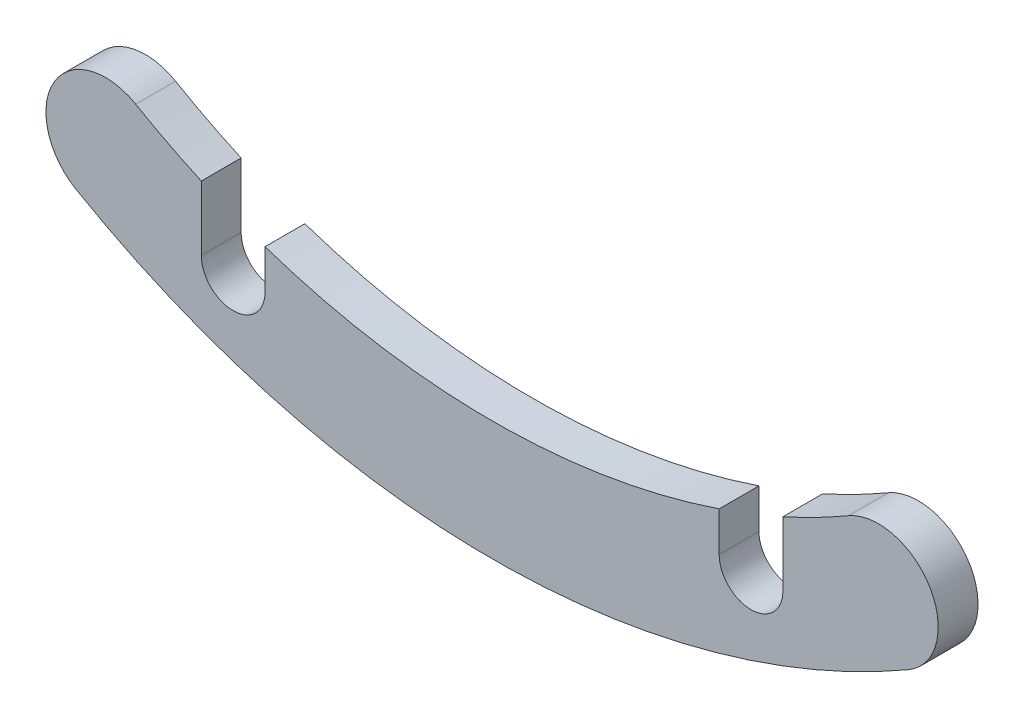
ISO-10303-21;
HEADER;
FILE_DESCRIPTION(('STEP AP214'),'2;1');
FILE_NAME('part.step','',(''),(''),'','','');
FILE_SCHEMA(('AUTOMOTIVE_DESIGN { 1 0 10303 214 1 1 1 1 }'));
ENDSEC;
DATA;
#1=APPLICATION_CONTEXT('core data for automotive mechanical design processes');
#2=APPLICATION_PROTOCOL_DEFINITION('international standard','automotive_design',2000,#1);
#3=PRODUCT_CONTEXT('',#1,'mechanical');
#4=PRODUCT('Part','Part','',(#3));
#5=PRODUCT_RELATED_PRODUCT_CATEGORY('part','',(#4));
#6=PRODUCT_DEFINITION_FORMATION('','',#4);
#7=PRODUCT_DEFINITION_CONTEXT('part definition',#1,'design');
#8=PRODUCT_DEFINITION('design','',#6,#7);
#9=PRODUCT_DEFINITION_SHAPE('','',#8);
#10=(LENGTH_UNIT() NAMED_UNIT(*) SI_UNIT(.MILLI.,.METRE.));
#11=(NAMED_UNIT(*) PLANE_ANGLE_UNIT() SI_UNIT($,.RADIAN.));
#12=(NAMED_UNIT(*) SI_UNIT($,.STERADIAN.) SOLID_ANGLE_UNIT());
#13=UNCERTAINTY_MEASURE_WITH_UNIT(LENGTH_MEASURE(1.E-05),#10,'distance_accuracy_value','');
#14=(GEOMETRIC_REPRESENTATION_CONTEXT(3) GLOBAL_UNCERTAINTY_ASSIGNED_CONTEXT((#13)) GLOBAL_UNIT_ASSIGNED_CONTEXT((#10,
#11,#12)) REPRESENTATION_CONTEXT('',''));
#15=CARTESIAN_POINT('',(0.,0.,0.));
#16=DIRECTION('',(0.,0.,1.));
#17=DIRECTION('',(1.,0.,0.));
#18=AXIS2_PLACEMENT_3D('',#15,#16,#17);
#19=CARTESIAN_POINT('',(0.,0.,-1.));
#20=DIRECTION('',(0.,0.,1.));
#21=DIRECTION('',(1.,0.,0.));
#22=AXIS2_PLACEMENT_3D('',#19,#20,#21);
#23=CYLINDRICAL_SURFACE('',#22,17.8);
#24=DIRECTION('',(0.,0.,1.));
#25=VECTOR('',#24,1.);
#26=CARTESIAN_POINT('',(5.69999999999999,-16.8626806884315,-1.));
#27=LINE('',#26,#25);
#28=CARTESIAN_POINT('',(5.69999999999999,-16.8626806884315,-1.));
#29=VERTEX_POINT('',#28);
#30=CARTESIAN_POINT('',(5.69999999999999,-16.8626806884315,0.));
#31=VERTEX_POINT('',#30);
#32=EDGE_CURVE('E170',#29,#31,#27,.T.);
#33=ORIENTED_EDGE('',*,*,#32,.F.);
#34=CARTESIAN_POINT('',(0.,0.,-1.));
#35=DIRECTION('',(0.,0.,-1.));
#36=DIRECTION('',(1.,0.,0.));
#37=AXIS2_PLACEMENT_3D('',#34,#35,#36);
#38=CIRCLE('',#37,17.8);
#39=CARTESIAN_POINT('',(-5.7,-16.8626806884315,-1.));
#40=VERTEX_POINT('',#39);
#41=EDGE_CURVE('E211',#29,#40,#38,.T.);
#42=ORIENTED_EDGE('',*,*,#41,.T.);
#43=DIRECTION('',(0.,0.,1.));
#44=VECTOR('',#43,1.);
#45=CARTESIAN_POINT('',(-5.7,-16.8626806884315,-1.));
#46=LINE('',#45,#44);
#47=CARTESIAN_POINT('',(-5.7,-16.8626806884315,0.));
#48=VERTEX_POINT('',#47);
#49=EDGE_CURVE('E189',#40,#48,#46,.T.);
#50=ORIENTED_EDGE('',*,*,#49,.T.);
#51=CARTESIAN_POINT('',(0.,0.,0.));
#52=DIRECTION('',(0.,0.,-1.));
#53=DIRECTION('',(1.,0.,0.));
#54=AXIS2_PLACEMENT_3D('',#51,#52,#53);
#55=CIRCLE('',#54,17.8);
#56=EDGE_CURVE('E222',#31,#48,#55,.T.);
#57=ORIENTED_EDGE('',*,*,#56,.F.);
#58=EDGE_LOOP('',(#33,#42,#50,#57));
#59=FACE_BOUND('',#58,.T.);
#60=ADVANCED_FACE('F47',(#59),#23,.F.);
#61=DIRECTION('',(0.,0.,1.));
#62=VECTOR('',#61,1.);
#63=CARTESIAN_POINT('',(7.29999999999999,-16.234223110454,-1.));
#64=LINE('',#63,#62);
#65=CARTESIAN_POINT('',(7.29999999999999,-16.234223110454,-1.));
#66=VERTEX_POINT('',#65);
#67=CARTESIAN_POINT('',(7.29999999999999,-16.234223110454,0.));
#68=VERTEX_POINT('',#67);
#69=EDGE_CURVE('E145',#66,#68,#64,.T.);
#70=ORIENTED_EDGE('',*,*,#69,.T.);
#71=CARTESIAN_POINT('',(8.94611398963731,-15.3885361384511,0.));
#72=VERTEX_POINT('',#71);
#73=EDGE_CURVE('E202',#72,#68,#55,.T.);
#74=ORIENTED_EDGE('',*,*,#73,.F.);
#75=DIRECTION('',(0.,0.,1.));
#76=VECTOR('',#75,1.);
#77=CARTESIAN_POINT('',(8.94611398963731,-15.3885361384511,-1.));
#78=LINE('',#77,#76);
#79=CARTESIAN_POINT('',(8.94611398963731,-15.3885361384511,-1.));
#80=VERTEX_POINT('',#79);
#81=EDGE_CURVE('E56',#80,#72,#78,.T.);
#82=ORIENTED_EDGE('',*,*,#81,.F.);
#83=EDGE_CURVE('E209',#80,#66,#38,.T.);
#84=ORIENTED_EDGE('',*,*,#83,.T.);
#85=EDGE_LOOP('',(#70,#74,#82,#84));
#86=FACE_BOUND('',#85,.T.);
#87=ADVANCED_FACE('F247',(#86),#23,.F.);
#88=CARTESIAN_POINT('',(-9.7,-16.6853228916914,-1.));
#89=DIRECTION('',(0.,0.,1.));
#90=DIRECTION('',(1.,0.,0.));
#91=AXIS2_PLACEMENT_3D('',#88,#89,#90);
#92=CYLINDRICAL_SURFACE('',#91,1.5);
#93=CARTESIAN_POINT('',(-9.7,-16.6853228916914,0.));
#94=DIRECTION('',(0.,0.,1.));
#95=DIRECTION('',(1.,0.,0.));
#96=AXIS2_PLACEMENT_3D('',#93,#94,#95);
#97=CIRCLE('',#96,1.5);
#98=CARTESIAN_POINT('',(-8.94611398963732,-15.3885361384511,0.));
#99=VERTEX_POINT('',#98);
#100=CARTESIAN_POINT('',(-10.4538860103627,-17.9821096449316,0.));
#101=VERTEX_POINT('',#100);
#102=EDGE_CURVE('E192',#99,#101,#97,.T.);
#103=ORIENTED_EDGE('',*,*,#102,.F.);
#104=DIRECTION('',(0.,0.,1.));
#105=VECTOR('',#104,1.);
#106=CARTESIAN_POINT('',(-8.94611398963732,-15.3885361384511,-1.));
#107=LINE('',#106,#105);
#108=CARTESIAN_POINT('',(-8.94611398963732,-15.3885361384511,-1.));
#109=VERTEX_POINT('',#108);
#110=EDGE_CURVE('E13',#109,#99,#107,.T.);
#111=ORIENTED_EDGE('',*,*,#110,.F.);
#112=CARTESIAN_POINT('',(-9.7,-16.6853228916914,-1.));
#113=DIRECTION('',(0.,0.,1.));
#114=DIRECTION('',(1.,0.,0.));
#115=AXIS2_PLACEMENT_3D('',#112,#113,#114);
#116=CIRCLE('',#115,1.5);
#117=CARTESIAN_POINT('',(-10.4538860103627,-17.9821096449316,-1.));
#118=VERTEX_POINT('',#117);
#119=EDGE_CURVE('E198',#109,#118,#116,.T.);
#120=ORIENTED_EDGE('',*,*,#119,.T.);
#121=DIRECTION('',(0.,0.,1.));
#122=VECTOR('',#121,1.);
#123=CARTESIAN_POINT('',(-10.4538860103627,-17.9821096449316,-1.));
#124=LINE('',#123,#122);
#125=EDGE_CURVE('E51',#118,#101,#124,.T.);
#126=ORIENTED_EDGE('',*,*,#125,.T.);
#127=EDGE_LOOP('',(#103,#111,#120,#126));
#128=FACE_BOUND('',#127,.T.);
#129=ADVANCED_FACE('F49',(#128),#92,.T.);
#130=DIRECTION('',(0.,0.,1.));
#131=VECTOR('',#130,1.);
#132=CARTESIAN_POINT('',(-7.3,-16.234223110454,-1.));
#133=LINE('',#132,#131);
#134=CARTESIAN_POINT('',(-7.3,-16.234223110454,-1.));
#135=VERTEX_POINT('',#134);
#136=CARTESIAN_POINT('',(-7.3,-16.234223110454,0.));
#137=VERTEX_POINT('',#136);
#138=EDGE_CURVE('E72',#135,#137,#133,.T.);
#139=ORIENTED_EDGE('',*,*,#138,.F.);
#140=EDGE_CURVE('E208',#135,#109,#38,.T.);
#141=ORIENTED_EDGE('',*,*,#140,.T.);
#142=ORIENTED_EDGE('',*,*,#110,.T.);
#143=EDGE_CURVE('E220',#137,#99,#55,.T.);
#144=ORIENTED_EDGE('',*,*,#143,.F.);
#145=EDGE_LOOP('',(#139,#141,#142,#144));
#146=FACE_BOUND('',#145,.T.);
#147=ADVANCED_FACE('F240',(#146),#23,.F.);
#148=CARTESIAN_POINT('',(9.7,-16.6853228916914,-1.));
#149=DIRECTION('',(0.,0.,1.));
#150=DIRECTION('',(1.,0.,0.));
#151=AXIS2_PLACEMENT_3D('',#148,#149,#150);
#152=CYLINDRICAL_SURFACE('',#151,1.5);
#153=CARTESIAN_POINT('',(9.7,-16.6853228916914,0.));
#154=DIRECTION('',(0.,0.,1.));
#155=DIRECTION('',(-1.,0.,0.));
#156=AXIS2_PLACEMENT_3D('',#153,#154,#155);
#157=CIRCLE('',#156,1.5);
#158=CARTESIAN_POINT('',(10.4538860103627,-17.9821096449316,0.));
#159=VERTEX_POINT('',#158);
#160=EDGE_CURVE('E217',#159,#72,#157,.T.);
#161=ORIENTED_EDGE('',*,*,#160,.F.);
#162=DIRECTION('',(0.,0.,1.));
#163=VECTOR('',#162,1.);
#164=CARTESIAN_POINT('',(10.4538860103627,-17.9821096449316,-1.));
#165=LINE('',#164,#163);
#166=CARTESIAN_POINT('',(10.4538860103627,-17.9821096449316,-1.));
#167=VERTEX_POINT('',#166);
#168=EDGE_CURVE('E224',#167,#159,#165,.T.);
#169=ORIENTED_EDGE('',*,*,#168,.F.);
#170=CARTESIAN_POINT('',(9.7,-16.6853228916914,-1.));
#171=DIRECTION('',(0.,0.,1.));
#172=DIRECTION('',(-1.,0.,0.));
#173=AXIS2_PLACEMENT_3D('',#170,#171,#172);
#174=CIRCLE('',#173,1.5);
#175=EDGE_CURVE('E205',#167,#80,#174,.T.);
#176=ORIENTED_EDGE('',*,*,#175,.T.);
#177=ORIENTED_EDGE('',*,*,#81,.T.);
#178=EDGE_LOOP('',(#161,#169,#176,#177));
#179=FACE_BOUND('',#178,.T.);
#180=ADVANCED_FACE('F244',(#179),#152,.T.);
#181=CARTESIAN_POINT('',(0.,0.,-1.));
#182=DIRECTION('',(0.,0.,1.));
#183=DIRECTION('',(1.,0.,0.));
#184=AXIS2_PLACEMENT_3D('',#181,#182,#183);
#185=CYLINDRICAL_SURFACE('',#184,20.8);
#186=CARTESIAN_POINT('',(0.,0.,0.));
#187=DIRECTION('',(0.,0.,1.));
#188=DIRECTION('',(1.,0.,0.));
#189=AXIS2_PLACEMENT_3D('',#186,#187,#188);
#190=CIRCLE('',#189,20.8);
#191=EDGE_CURVE('E214',#101,#159,#190,.T.);
#192=ORIENTED_EDGE('',*,*,#191,.F.);
#193=ORIENTED_EDGE('',*,*,#125,.F.);
#194=CARTESIAN_POINT('',(0.,0.,-1.));
#195=DIRECTION('',(0.,0.,1.));
#196=DIRECTION('',(1.,0.,0.));
#197=AXIS2_PLACEMENT_3D('',#194,#195,#196);
#198=CIRCLE('',#197,20.8);
#199=EDGE_CURVE('E201',#118,#167,#198,.T.);
#200=ORIENTED_EDGE('',*,*,#199,.T.);
#201=ORIENTED_EDGE('',*,*,#168,.T.);
#202=EDGE_LOOP('',(#192,#193,#200,#201));
#203=FACE_BOUND('',#202,.T.);
#204=ADVANCED_FACE('F233',(#203),#185,.T.);
#205=CARTESIAN_POINT('',(-4.85,-8.34266144584569,-1.));
#206=DIRECTION('',(0.,0.,1.));
#207=DIRECTION('',(1.,0.,0.));
#208=AXIS2_PLACEMENT_3D('',#205,#206,#207);
#209=PLANE('',#208);
#210=ORIENTED_EDGE('',*,*,#41,.F.);
#211=DIRECTION('',(0.,-1.,0.));
#212=VECTOR('',#211,1.);
#213=CARTESIAN_POINT('',(5.7,-17.8535710713571,-1.));
#214=LINE('',#213,#212);
#215=CARTESIAN_POINT('',(5.7,-17.8535710713571,-1.));
#216=VERTEX_POINT('',#215);
#217=EDGE_CURVE('E146',#29,#216,#214,.T.);
#218=ORIENTED_EDGE('',*,*,#217,.T.);
#219=CARTESIAN_POINT('',(6.5,-17.8535710713571,-1.));
#220=DIRECTION('',(0.,0.,1.));
#221=DIRECTION('',(-1.,0.,0.));
#222=AXIS2_PLACEMENT_3D('',#219,#220,#221);
#223=CIRCLE('',#222,0.8);
#224=CARTESIAN_POINT('',(7.3,-17.8535710713571,-1.));
#225=VERTEX_POINT('',#224);
#226=EDGE_CURVE('E141',#216,#225,#223,.T.);
#227=ORIENTED_EDGE('',*,*,#226,.T.);
#228=DIRECTION('',(0.,1.,0.));
#229=VECTOR('',#228,1.);
#230=CARTESIAN_POINT('',(7.3,-17.8535710713571,-1.));
#231=LINE('',#230,#229);
#232=EDGE_CURVE('E149',#225,#66,#231,.T.);
#233=ORIENTED_EDGE('',*,*,#232,.T.);
#234=ORIENTED_EDGE('',*,*,#83,.F.);
#235=ORIENTED_EDGE('',*,*,#175,.F.);
#236=ORIENTED_EDGE('',*,*,#199,.F.);
#237=ORIENTED_EDGE('',*,*,#119,.F.);
#238=ORIENTED_EDGE('',*,*,#140,.F.);
#239=DIRECTION('',(0.,-1.,0.));
#240=VECTOR('',#239,1.);
#241=CARTESIAN_POINT('',(-7.3,-17.8535710713571,-1.));
#242=LINE('',#241,#240);
#243=CARTESIAN_POINT('',(-7.3,-17.8535710713571,-1.));
#244=VERTEX_POINT('',#243);
#245=EDGE_CURVE('E173',#135,#244,#242,.T.);
#246=ORIENTED_EDGE('',*,*,#245,.T.);
#247=CARTESIAN_POINT('',(-6.5,-17.8535710713571,-1.));
#248=DIRECTION('',(0.,0.,1.));
#249=DIRECTION('',(1.,0.,0.));
#250=AXIS2_PLACEMENT_3D('',#247,#248,#249);
#251=CIRCLE('',#250,0.8);
#252=CARTESIAN_POINT('',(-5.7,-17.8535710713571,-1.));
#253=VERTEX_POINT('',#252);
#254=EDGE_CURVE('E176',#244,#253,#251,.T.);
#255=ORIENTED_EDGE('',*,*,#254,.T.);
#256=DIRECTION('',(0.,1.,0.));
#257=VECTOR('',#256,1.);
#258=CARTESIAN_POINT('',(-5.7,-17.8535710713571,-1.));
#259=LINE('',#258,#257);
#260=EDGE_CURVE('E180',#253,#40,#259,.T.);
#261=ORIENTED_EDGE('',*,*,#260,.T.);
#262=EDGE_LOOP('',(#210,#218,#227,#233,#234,#235,#236,#237,#238,#246,#255,#261));
#263=FACE_BOUND('',#262,.T.);
#264=ADVANCED_FACE('F157',(#263),#209,.F.);
#265=CARTESIAN_POINT('',(-4.85,-8.34266144584569,0.));
#266=DIRECTION('',(0.,0.,1.));
#267=DIRECTION('',(1.,0.,0.));
#268=AXIS2_PLACEMENT_3D('',#265,#266,#267);
#269=PLANE('',#268);
#270=DIRECTION('',(0.,-1.,0.));
#271=VECTOR('',#270,1.);
#272=CARTESIAN_POINT('',(5.7,-17.8535710713571,0.));
#273=LINE('',#272,#271);
#274=CARTESIAN_POINT('',(5.7,-17.8535710713571,0.));
#275=VERTEX_POINT('',#274);
#276=EDGE_CURVE('E158',#31,#275,#273,.T.);
#277=ORIENTED_EDGE('',*,*,#276,.F.);
#278=ORIENTED_EDGE('',*,*,#56,.T.);
#279=DIRECTION('',(0.,1.,0.));
#280=VECTOR('',#279,1.);
#281=CARTESIAN_POINT('',(-5.7,-17.8535710713571,0.));
#282=LINE('',#281,#280);
#283=CARTESIAN_POINT('',(-5.7,-17.8535710713571,0.));
#284=VERTEX_POINT('',#283);
#285=EDGE_CURVE('E177',#284,#48,#282,.T.);
#286=ORIENTED_EDGE('',*,*,#285,.F.);
#287=CARTESIAN_POINT('',(-6.5,-17.8535710713571,0.));
#288=DIRECTION('',(0.,0.,1.));
#289=DIRECTION('',(1.,0.,0.));
#290=AXIS2_PLACEMENT_3D('',#287,#288,#289);
#291=CIRCLE('',#290,0.8);
#292=CARTESIAN_POINT('',(-7.3,-17.8535710713571,0.));
#293=VERTEX_POINT('',#292);
#294=EDGE_CURVE('E184',#293,#284,#291,.T.);
#295=ORIENTED_EDGE('',*,*,#294,.F.);
#296=DIRECTION('',(0.,-1.,0.));
#297=VECTOR('',#296,1.);
#298=CARTESIAN_POINT('',(-7.3,-17.8535710713571,0.));
#299=LINE('',#298,#297);
#300=EDGE_CURVE('E169',#137,#293,#299,.T.);
#301=ORIENTED_EDGE('',*,*,#300,.F.);
#302=ORIENTED_EDGE('',*,*,#143,.T.);
#303=ORIENTED_EDGE('',*,*,#102,.T.);
#304=ORIENTED_EDGE('',*,*,#191,.T.);
#305=ORIENTED_EDGE('',*,*,#160,.T.);
#306=ORIENTED_EDGE('',*,*,#73,.T.);
#307=DIRECTION('',(0.,1.,0.));
#308=VECTOR('',#307,1.);
#309=CARTESIAN_POINT('',(7.3,-17.8535710713571,0.));
#310=LINE('',#309,#308);
#311=CARTESIAN_POINT('',(7.3,-17.8535710713571,0.));
#312=VERTEX_POINT('',#311);
#313=EDGE_CURVE('E161',#312,#68,#310,.T.);
#314=ORIENTED_EDGE('',*,*,#313,.F.);
#315=CARTESIAN_POINT('',(6.5,-17.8535710713571,0.));
#316=DIRECTION('',(0.,0.,1.));
#317=DIRECTION('',(-1.,0.,0.));
#318=AXIS2_PLACEMENT_3D('',#315,#316,#317);
#319=CIRCLE('',#318,0.8);
#320=EDGE_CURVE('E64',#275,#312,#319,.T.);
#321=ORIENTED_EDGE('',*,*,#320,.F.);
#322=EDGE_LOOP('',(#277,#278,#286,#295,#301,#302,#303,#304,#305,#306,#314,#321));
#323=FACE_BOUND('',#322,.T.);
#324=ADVANCED_FACE('F236',(#323),#269,.T.);
#325=CARTESIAN_POINT('',(-5.7,-17.8535710713571,-1.));
#326=DIRECTION('',(1.,0.,0.));
#327=DIRECTION('',(0.,0.,-1.));
#328=AXIS2_PLACEMENT_3D('',#325,#326,#327);
#329=PLANE('',#328);
#330=ORIENTED_EDGE('',*,*,#285,.T.);
#331=ORIENTED_EDGE('',*,*,#49,.F.);
#332=ORIENTED_EDGE('',*,*,#260,.F.);
#333=DIRECTION('',(0.,0.,1.));
#334=VECTOR('',#333,1.);
#335=CARTESIAN_POINT('',(-5.7,-17.8535710713571,-1.));
#336=LINE('',#335,#334);
#337=EDGE_CURVE('E193',#253,#284,#336,.T.);
#338=ORIENTED_EDGE('',*,*,#337,.T.);
#339=EDGE_LOOP('',(#330,#331,#332,#338));
#340=FACE_BOUND('',#339,.T.);
#341=ADVANCED_FACE('F271',(#340),#329,.F.);
#342=CARTESIAN_POINT('',(-6.5,-17.8535710713571,-1.));
#343=DIRECTION('',(0.,0.,1.));
#344=DIRECTION('',(1.,0.,0.));
#345=AXIS2_PLACEMENT_3D('',#342,#343,#344);
#346=CYLINDRICAL_SURFACE('',#345,0.8);
#347=ORIENTED_EDGE('',*,*,#294,.T.);
#348=ORIENTED_EDGE('',*,*,#337,.F.);
#349=ORIENTED_EDGE('',*,*,#254,.F.);
#350=DIRECTION('',(0.,0.,1.));
#351=VECTOR('',#350,1.);
#352=CARTESIAN_POINT('',(-7.3,-17.8535710713571,-1.));
#353=LINE('',#352,#351);
#354=EDGE_CURVE('E195',#244,#293,#353,.T.);
#355=ORIENTED_EDGE('',*,*,#354,.T.);
#356=EDGE_LOOP('',(#347,#348,#349,#355));
#357=FACE_BOUND('',#356,.T.);
#358=ADVANCED_FACE('F276',(#357),#346,.F.);
#359=CARTESIAN_POINT('',(-7.3,-17.8535710713571,-1.));
#360=DIRECTION('',(-1.,0.,0.));
#361=DIRECTION('',(0.,-1.,0.));
#362=AXIS2_PLACEMENT_3D('',#359,#360,#361);
#363=PLANE('',#362);
#364=ORIENTED_EDGE('',*,*,#300,.T.);
#365=ORIENTED_EDGE('',*,*,#354,.F.);
#366=ORIENTED_EDGE('',*,*,#245,.F.);
#367=ORIENTED_EDGE('',*,*,#138,.T.);
#368=EDGE_LOOP('',(#364,#365,#366,#367));
#369=FACE_BOUND('',#368,.T.);
#370=ADVANCED_FACE('F273',(#369),#363,.F.);
#371=CARTESIAN_POINT('',(6.5,-17.8535710713571,-1.));
#372=DIRECTION('',(0.,0.,1.));
#373=DIRECTION('',(1.,0.,0.));
#374=AXIS2_PLACEMENT_3D('',#371,#372,#373);
#375=CYLINDRICAL_SURFACE('',#374,0.8);
#376=ORIENTED_EDGE('',*,*,#320,.T.);
#377=DIRECTION('',(0.,0.,1.));
#378=VECTOR('',#377,1.);
#379=CARTESIAN_POINT('',(7.3,-17.8535710713571,-1.));
#380=LINE('',#379,#378);
#381=EDGE_CURVE('E137',#225,#312,#380,.T.);
#382=ORIENTED_EDGE('',*,*,#381,.F.);
#383=ORIENTED_EDGE('',*,*,#226,.F.);
#384=DIRECTION('',(0.,0.,1.));
#385=VECTOR('',#384,1.);
#386=CARTESIAN_POINT('',(5.7,-17.8535710713571,-1.));
#387=LINE('',#386,#385);
#388=EDGE_CURVE('E167',#216,#275,#387,.T.);
#389=ORIENTED_EDGE('',*,*,#388,.T.);
#390=EDGE_LOOP('',(#376,#382,#383,#389));
#391=FACE_BOUND('',#390,.T.);
#392=ADVANCED_FACE('F139',(#391),#375,.F.);
#393=CARTESIAN_POINT('',(5.7,-17.8535710713571,-1.));
#394=DIRECTION('',(-1.,0.,0.));
#395=DIRECTION('',(0.,-1.,0.));
#396=AXIS2_PLACEMENT_3D('',#393,#394,#395);
#397=PLANE('',#396);
#398=ORIENTED_EDGE('',*,*,#276,.T.);
#399=ORIENTED_EDGE('',*,*,#388,.F.);
#400=ORIENTED_EDGE('',*,*,#217,.F.);
#401=ORIENTED_EDGE('',*,*,#32,.T.);
#402=EDGE_LOOP('',(#398,#399,#400,#401));
#403=FACE_BOUND('',#402,.T.);
#404=ADVANCED_FACE('F285',(#403),#397,.F.);
#405=CARTESIAN_POINT('',(7.3,-17.8535710713571,-1.));
#406=DIRECTION('',(1.,0.,0.));
#407=DIRECTION('',(0.,1.,0.));
#408=AXIS2_PLACEMENT_3D('',#405,#406,#407);
#409=PLANE('',#408);
#410=ORIENTED_EDGE('',*,*,#313,.T.);
#411=ORIENTED_EDGE('',*,*,#69,.F.);
#412=ORIENTED_EDGE('',*,*,#232,.F.);
#413=ORIENTED_EDGE('',*,*,#381,.T.);
#414=EDGE_LOOP('',(#410,#411,#412,#413));
#415=FACE_BOUND('',#414,.T.);
#416=ADVANCED_FACE('F150',(#415),#409,.F.);
#417=CLOSED_SHELL('',(#60,#87,#129,#147,#180,#204,#264,#324,#341,#358,#370,#392,#404,#416));
#418=MANIFOLD_SOLID_BREP('B2',#417);
#419=ADVANCED_BREP_SHAPE_REPRESENTATION('',(#18,#418),#14);
#420=SHAPE_DEFINITION_REPRESENTATION(#9,#419);
ENDSEC;
END-ISO-10303-21;
